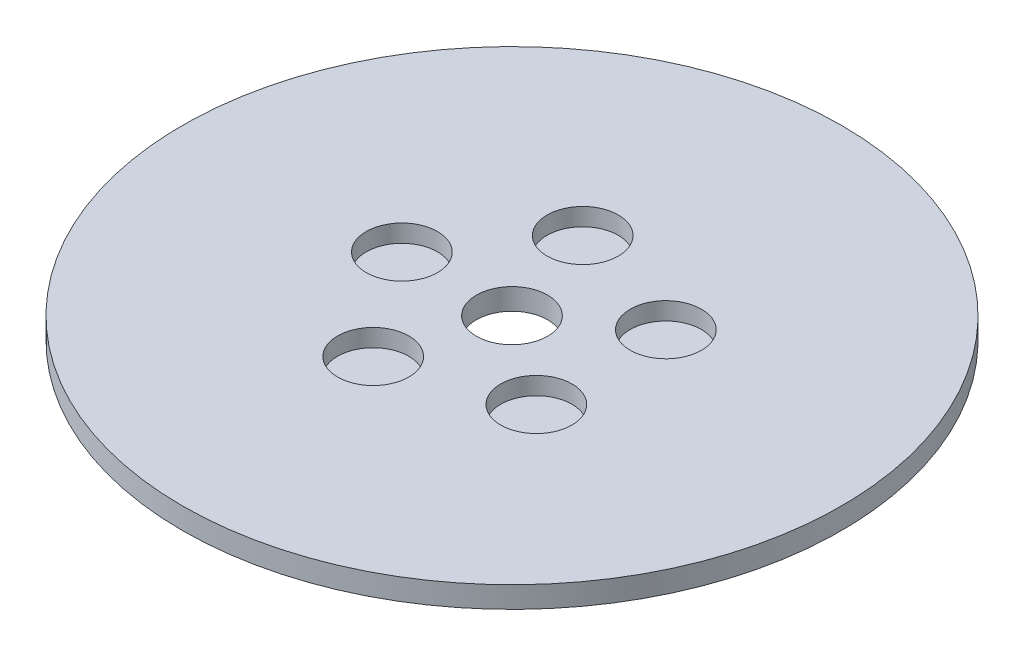
ISO-10303-21;
HEADER;
FILE_DESCRIPTION(('STEP AP214'),'2;1');
FILE_NAME('part.step','',(''),(''),'','','');
FILE_SCHEMA(('AUTOMOTIVE_DESIGN { 1 0 10303 214 1 1 1 1 }'));
ENDSEC;
DATA;
#1=APPLICATION_CONTEXT('core data for automotive mechanical design processes');
#2=APPLICATION_PROTOCOL_DEFINITION('international standard','automotive_design',2000,#1);
#3=PRODUCT_CONTEXT('',#1,'mechanical');
#4=PRODUCT('Part','Part','',(#3));
#5=PRODUCT_RELATED_PRODUCT_CATEGORY('part','',(#4));
#6=PRODUCT_DEFINITION_FORMATION('','',#4);
#7=PRODUCT_DEFINITION_CONTEXT('part definition',#1,'design');
#8=PRODUCT_DEFINITION('design','',#6,#7);
#9=PRODUCT_DEFINITION_SHAPE('','',#8);
#10=(LENGTH_UNIT() NAMED_UNIT(*) SI_UNIT(.MILLI.,.METRE.));
#11=(NAMED_UNIT(*) PLANE_ANGLE_UNIT() SI_UNIT($,.RADIAN.));
#12=(NAMED_UNIT(*) SI_UNIT($,.STERADIAN.) SOLID_ANGLE_UNIT());
#13=UNCERTAINTY_MEASURE_WITH_UNIT(LENGTH_MEASURE(1.E-05),#10,'distance_accuracy_value','');
#14=(GEOMETRIC_REPRESENTATION_CONTEXT(3) GLOBAL_UNCERTAINTY_ASSIGNED_CONTEXT((#13)) GLOBAL_UNIT_ASSIGNED_CONTEXT((#10,
#11,#12)) REPRESENTATION_CONTEXT('',''));
#15=CARTESIAN_POINT('',(0.,0.,0.));
#16=DIRECTION('',(0.,0.,1.));
#17=DIRECTION('',(1.,0.,0.));
#18=AXIS2_PLACEMENT_3D('',#15,#16,#17);
#19=CARTESIAN_POINT('',(0.,6.,0.));
#20=DIRECTION('',(0.,-1.,0.));
#21=DIRECTION('',(0.,0.,-1.));
#22=AXIS2_PLACEMENT_3D('',#19,#20,#21);
#23=CYLINDRICAL_SURFACE('',#22,92.5);
#24=CARTESIAN_POINT('',(0.,6.,0.));
#25=DIRECTION('',(0.,1.,0.));
#26=DIRECTION('',(0.,0.,1.));
#27=AXIS2_PLACEMENT_3D('',#24,#25,#26);
#28=CIRCLE('',#27,92.5);
#29=CARTESIAN_POINT('',(0.,6.,92.5));
#30=VERTEX_POINT('',#29);
#31=EDGE_CURVE('E10',#30,#30,#28,.T.);
#32=ORIENTED_EDGE('',*,*,#31,.F.);
#33=EDGE_LOOP('',(#32));
#34=FACE_BOUND('',#33,.T.);
#35=CARTESIAN_POINT('',(0.,0.,0.));
#36=DIRECTION('',(0.,1.,0.));
#37=DIRECTION('',(0.,0.,1.));
#38=AXIS2_PLACEMENT_3D('',#35,#36,#37);
#39=CIRCLE('',#38,92.5);
#40=CARTESIAN_POINT('',(0.,0.,92.5));
#41=VERTEX_POINT('',#40);
#42=EDGE_CURVE('E37',#41,#41,#39,.T.);
#43=ORIENTED_EDGE('',*,*,#42,.T.);
#44=EDGE_LOOP('',(#43));
#45=FACE_BOUND('',#44,.T.);
#46=ADVANCED_FACE('F40',(#34,#45),#23,.T.);
#47=CARTESIAN_POINT('',(0.,6.,0.));
#48=DIRECTION('',(0.,1.,0.));
#49=DIRECTION('',(0.,0.,1.));
#50=AXIS2_PLACEMENT_3D('',#47,#48,#49);
#51=PLANE('',#50);
#52=CARTESIAN_POINT('',(-9.55319121148081,6.,-29.4016993190607));
#53=DIRECTION('',(0.,1.,0.));
#54=DIRECTION('',(-0.95105651629515,0.,0.309016994374958));
#55=AXIS2_PLACEMENT_3D('',#52,#53,#54);
#56=CIRCLE('',#55,10.);
#57=CARTESIAN_POINT('',(-19.0637563744323,6.,-26.3115293753111));
#58=VERTEX_POINT('',#57);
#59=EDGE_CURVE('E70',#58,#58,#56,.T.);
#60=ORIENTED_EDGE('',*,*,#59,.F.);
#61=EDGE_LOOP('',(#60));
#62=FACE_BOUND('',#61,.T.);
#63=CARTESIAN_POINT('',(25.0105792926825,6.,-18.1712495061844));
#64=DIRECTION('',(0.,1.,0.));
#65=DIRECTION('',(-0.58778525229248,0.,-0.809016994374942));
#66=AXIS2_PLACEMENT_3D('',#63,#64,#65);
#67=CIRCLE('',#66,10.);
#68=CARTESIAN_POINT('',(19.1327267697577,6.,-26.2614194499338));
#69=VERTEX_POINT('',#68);
#70=EDGE_CURVE('E71',#69,#69,#67,.T.);
#71=ORIENTED_EDGE('',*,*,#70,.F.);
#72=EDGE_LOOP('',(#71));
#73=FACE_BOUND('',#72,.T.);
#74=CARTESIAN_POINT('',(25.0105792926828,6.,18.1712495061841));
#75=DIRECTION('',(0.,1.,0.));
#76=DIRECTION('',(0.587785252292469,0.,-0.809016994374951));
#77=AXIS2_PLACEMENT_3D('',#74,#75,#76);
#78=CIRCLE('',#77,10.);
#79=CARTESIAN_POINT('',(30.8884318156075,6.,10.0810795624345));
#80=VERTEX_POINT('',#79);
#81=EDGE_CURVE('E78',#80,#80,#78,.T.);
#82=ORIENTED_EDGE('',*,*,#81,.F.);
#83=EDGE_LOOP('',(#82));
#84=FACE_BOUND('',#83,.T.);
#85=CARTESIAN_POINT('',(-9.55319121148039,6.,29.4016993190608));
#86=DIRECTION('',(0.,1.,0.));
#87=DIRECTION('',(0.951056516295155,0.,0.309016994374945));
#88=AXIS2_PLACEMENT_3D('',#85,#86,#87);
#89=CIRCLE('',#88,10.);
#90=CARTESIAN_POINT('',(-0.0426260485288446,6.,32.4918692628102));
#91=VERTEX_POINT('',#90);
#92=EDGE_CURVE('E61',#91,#91,#89,.T.);
#93=ORIENTED_EDGE('',*,*,#92,.F.);
#94=EDGE_LOOP('',(#93));
#95=FACE_BOUND('',#94,.T.);
#96=CARTESIAN_POINT('',(-30.9147761624044,6.,0.));
#97=DIRECTION('',(0.,1.,0.));
#98=DIRECTION('',(0.,0.,1.));
#99=AXIS2_PLACEMENT_3D('',#96,#97,#98);
#100=CIRCLE('',#99,10.);
#101=CARTESIAN_POINT('',(-30.9147761624044,6.,10.));
#102=VERTEX_POINT('',#101);
#103=EDGE_CURVE('E54',#102,#102,#100,.T.);
#104=ORIENTED_EDGE('',*,*,#103,.F.);
#105=EDGE_LOOP('',(#104));
#106=FACE_BOUND('',#105,.T.);
#107=CARTESIAN_POINT('',(0.,6.,0.));
#108=DIRECTION('',(0.,1.,0.));
#109=DIRECTION('',(0.,0.,1.));
#110=AXIS2_PLACEMENT_3D('',#107,#108,#109);
#111=CIRCLE('',#110,10.);
#112=CARTESIAN_POINT('',(0.,6.,10.));
#113=VERTEX_POINT('',#112);
#114=EDGE_CURVE('E50',#113,#113,#111,.T.);
#115=ORIENTED_EDGE('',*,*,#114,.F.);
#116=EDGE_LOOP('',(#115));
#117=FACE_BOUND('',#116,.T.);
#118=ORIENTED_EDGE('',*,*,#31,.T.);
#119=EDGE_LOOP('',(#118));
#120=FACE_BOUND('',#119,.T.);
#121=ADVANCED_FACE('F94',(#62,#73,#84,#95,#106,#117,#120),#51,.T.);
#122=CARTESIAN_POINT('',(0.,0.,0.));
#123=DIRECTION('',(0.,1.,0.));
#124=DIRECTION('',(0.,0.,1.));
#125=AXIS2_PLACEMENT_3D('',#122,#123,#124);
#126=PLANE('',#125);
#127=CARTESIAN_POINT('',(0.,0.,0.));
#128=DIRECTION('',(0.,1.,0.));
#129=DIRECTION('',(0.,0.,1.));
#130=AXIS2_PLACEMENT_3D('',#127,#128,#129);
#131=CIRCLE('',#130,10.);
#132=CARTESIAN_POINT('',(0.,0.,10.));
#133=VERTEX_POINT('',#132);
#134=EDGE_CURVE('E47',#133,#133,#131,.T.);
#135=ORIENTED_EDGE('',*,*,#134,.T.);
#136=EDGE_LOOP('',(#135));
#137=FACE_BOUND('',#136,.T.);
#138=ORIENTED_EDGE('',*,*,#42,.F.);
#139=EDGE_LOOP('',(#138));
#140=FACE_BOUND('',#139,.T.);
#141=ADVANCED_FACE('F100',(#137,#140),#126,.F.);
#142=CARTESIAN_POINT('',(0.,6.,0.));
#143=DIRECTION('',(0.,-1.,0.));
#144=DIRECTION('',(0.,0.,-1.));
#145=AXIS2_PLACEMENT_3D('',#142,#143,#144);
#146=CYLINDRICAL_SURFACE('',#145,10.);
#147=ORIENTED_EDGE('',*,*,#114,.T.);
#148=EDGE_LOOP('',(#147));
#149=FACE_BOUND('',#148,.T.);
#150=ORIENTED_EDGE('',*,*,#134,.F.);
#151=EDGE_LOOP('',(#150));
#152=FACE_BOUND('',#151,.T.);
#153=ADVANCED_FACE('F106',(#149,#152),#146,.F.);
#154=CARTESIAN_POINT('',(-30.9147761624044,1.05802698753369,0.));
#155=DIRECTION('',(0.,1.,0.));
#156=DIRECTION('',(0.,0.,1.));
#157=AXIS2_PLACEMENT_3D('',#154,#155,#156);
#158=CYLINDRICAL_SURFACE('',#157,10.);
#159=CARTESIAN_POINT('',(-30.9147761624044,1.05802698753369,0.));
#160=DIRECTION('',(0.,1.,0.));
#161=DIRECTION('',(0.,0.,1.));
#162=AXIS2_PLACEMENT_3D('',#159,#160,#161);
#163=CIRCLE('',#162,10.);
#164=CARTESIAN_POINT('',(-30.9147761624044,1.05802698753369,10.));
#165=VERTEX_POINT('',#164);
#166=EDGE_CURVE('E55',#165,#165,#163,.T.);
#167=ORIENTED_EDGE('',*,*,#166,.F.);
#168=EDGE_LOOP('',(#167));
#169=FACE_BOUND('',#168,.T.);
#170=ORIENTED_EDGE('',*,*,#103,.T.);
#171=EDGE_LOOP('',(#170));
#172=FACE_BOUND('',#171,.T.);
#173=ADVANCED_FACE('F108',(#169,#172),#158,.F.);
#174=CARTESIAN_POINT('',(-30.9147761624044,1.05802698753369,0.));
#175=DIRECTION('',(0.,1.,0.));
#176=DIRECTION('',(0.,0.,1.));
#177=AXIS2_PLACEMENT_3D('',#174,#175,#176);
#178=PLANE('',#177);
#179=ORIENTED_EDGE('',*,*,#166,.T.);
#180=EDGE_LOOP('',(#179));
#181=FACE_BOUND('',#180,.T.);
#182=ADVANCED_FACE('F138',(#181),#178,.T.);
#183=CARTESIAN_POINT('',(-9.55319121148039,1.05802698753369,29.4016993190608));
#184=DIRECTION('',(0.,1.,0.));
#185=DIRECTION('',(0.,0.,1.));
#186=AXIS2_PLACEMENT_3D('',#183,#184,#185);
#187=CYLINDRICAL_SURFACE('',#186,10.);
#188=CARTESIAN_POINT('',(-9.55319121148039,1.05802698753369,29.4016993190608));
#189=DIRECTION('',(0.,1.,0.));
#190=DIRECTION('',(0.951056516295155,0.,0.309016994374945));
#191=AXIS2_PLACEMENT_3D('',#188,#189,#190);
#192=CIRCLE('',#191,10.);
#193=CARTESIAN_POINT('',(-0.0426260485288446,1.05802698753369,32.4918692628102));
#194=VERTEX_POINT('',#193);
#195=EDGE_CURVE('E59',#194,#194,#192,.T.);
#196=ORIENTED_EDGE('',*,*,#195,.F.);
#197=EDGE_LOOP('',(#196));
#198=FACE_BOUND('',#197,.T.);
#199=ORIENTED_EDGE('',*,*,#92,.T.);
#200=EDGE_LOOP('',(#199));
#201=FACE_BOUND('',#200,.T.);
#202=ADVANCED_FACE('F150',(#198,#201),#187,.F.);
#203=CARTESIAN_POINT('',(-9.55319121148039,1.05802698753369,29.4016993190608));
#204=DIRECTION('',(0.,1.,0.));
#205=DIRECTION('',(0.951056516295155,0.,0.309016994374945));
#206=AXIS2_PLACEMENT_3D('',#203,#204,#205);
#207=PLANE('',#206);
#208=ORIENTED_EDGE('',*,*,#195,.T.);
#209=EDGE_LOOP('',(#208));
#210=FACE_BOUND('',#209,.T.);
#211=ADVANCED_FACE('F89',(#210),#207,.T.);
#212=CARTESIAN_POINT('',(25.0105792926828,1.05802698753369,18.1712495061841));
#213=DIRECTION('',(0.,1.,0.));
#214=DIRECTION('',(0.,0.,1.));
#215=AXIS2_PLACEMENT_3D('',#212,#213,#214);
#216=CYLINDRICAL_SURFACE('',#215,10.);
#217=CARTESIAN_POINT('',(25.0105792926828,1.05802698753369,18.1712495061841));
#218=DIRECTION('',(0.,1.,0.));
#219=DIRECTION('',(0.587785252292469,0.,-0.809016994374951));
#220=AXIS2_PLACEMENT_3D('',#217,#218,#219);
#221=CIRCLE('',#220,10.);
#222=CARTESIAN_POINT('',(30.8884318156075,1.05802698753369,10.0810795624345));
#223=VERTEX_POINT('',#222);
#224=EDGE_CURVE('E63',#223,#223,#221,.T.);
#225=ORIENTED_EDGE('',*,*,#224,.F.);
#226=EDGE_LOOP('',(#225));
#227=FACE_BOUND('',#226,.T.);
#228=ORIENTED_EDGE('',*,*,#81,.T.);
#229=EDGE_LOOP('',(#228));
#230=FACE_BOUND('',#229,.T.);
#231=ADVANCED_FACE('F87',(#227,#230),#216,.F.);
#232=CARTESIAN_POINT('',(25.0105792926828,1.05802698753369,18.1712495061841));
#233=DIRECTION('',(0.,1.,0.));
#234=DIRECTION('',(0.587785252292469,0.,-0.809016994374951));
#235=AXIS2_PLACEMENT_3D('',#232,#233,#234);
#236=PLANE('',#235);
#237=ORIENTED_EDGE('',*,*,#224,.T.);
#238=EDGE_LOOP('',(#237));
#239=FACE_BOUND('',#238,.T.);
#240=ADVANCED_FACE('F84',(#239),#236,.T.);
#241=CARTESIAN_POINT('',(25.0105792926825,1.05802698753369,-18.1712495061844));
#242=DIRECTION('',(0.,1.,0.));
#243=DIRECTION('',(0.,0.,1.));
#244=AXIS2_PLACEMENT_3D('',#241,#242,#243);
#245=CYLINDRICAL_SURFACE('',#244,10.);
#246=CARTESIAN_POINT('',(25.0105792926825,1.05802698753369,-18.1712495061844));
#247=DIRECTION('',(0.,1.,0.));
#248=DIRECTION('',(-0.58778525229248,0.,-0.809016994374942));
#249=AXIS2_PLACEMENT_3D('',#246,#247,#248);
#250=CIRCLE('',#249,10.);
#251=CARTESIAN_POINT('',(19.1327267697577,1.05802698753369,-26.2614194499338));
#252=VERTEX_POINT('',#251);
#253=EDGE_CURVE('E76',#252,#252,#250,.T.);
#254=ORIENTED_EDGE('',*,*,#253,.F.);
#255=EDGE_LOOP('',(#254));
#256=FACE_BOUND('',#255,.T.);
#257=ORIENTED_EDGE('',*,*,#70,.T.);
#258=EDGE_LOOP('',(#257));
#259=FACE_BOUND('',#258,.T.);
#260=ADVANCED_FACE('F185',(#256,#259),#245,.F.);
#261=CARTESIAN_POINT('',(25.0105792926825,1.05802698753369,-18.1712495061844));
#262=DIRECTION('',(0.,1.,0.));
#263=DIRECTION('',(-0.58778525229248,0.,-0.809016994374942));
#264=AXIS2_PLACEMENT_3D('',#261,#262,#263);
#265=PLANE('',#264);
#266=ORIENTED_EDGE('',*,*,#253,.T.);
#267=EDGE_LOOP('',(#266));
#268=FACE_BOUND('',#267,.T.);
#269=ADVANCED_FACE('F189',(#268),#265,.T.);
#270=CARTESIAN_POINT('',(-9.55319121148081,1.05802698753369,-29.4016993190607));
#271=DIRECTION('',(0.,1.,0.));
#272=DIRECTION('',(0.,0.,1.));
#273=AXIS2_PLACEMENT_3D('',#270,#271,#272);
#274=CYLINDRICAL_SURFACE('',#273,10.);
#275=CARTESIAN_POINT('',(-9.55319121148081,1.05802698753369,-29.4016993190607));
#276=DIRECTION('',(0.,1.,0.));
#277=DIRECTION('',(-0.95105651629515,0.,0.309016994374958));
#278=AXIS2_PLACEMENT_3D('',#275,#276,#277);
#279=CIRCLE('',#278,10.);
#280=CARTESIAN_POINT('',(-19.0637563744323,1.05802698753369,-26.3115293753111));
#281=VERTEX_POINT('',#280);
#282=EDGE_CURVE('E69',#281,#281,#279,.T.);
#283=ORIENTED_EDGE('',*,*,#282,.F.);
#284=EDGE_LOOP('',(#283));
#285=FACE_BOUND('',#284,.T.);
#286=ORIENTED_EDGE('',*,*,#59,.T.);
#287=EDGE_LOOP('',(#286));
#288=FACE_BOUND('',#287,.T.);
#289=ADVANCED_FACE('F200',(#285,#288),#274,.F.);
#290=CARTESIAN_POINT('',(-9.55319121148081,1.05802698753369,-29.4016993190607));
#291=DIRECTION('',(0.,1.,0.));
#292=DIRECTION('',(-0.95105651629515,0.,0.309016994374958));
#293=AXIS2_PLACEMENT_3D('',#290,#291,#292);
#294=PLANE('',#293);
#295=ORIENTED_EDGE('',*,*,#282,.T.);
#296=EDGE_LOOP('',(#295));
#297=FACE_BOUND('',#296,.T.);
#298=ADVANCED_FACE('F208',(#297),#294,.T.);
#299=CLOSED_SHELL('',(#46,#121,#141,#153,#173,#182,#202,#211,#231,#240,#260,#269,#289,#298));
#300=MANIFOLD_SOLID_BREP('B2',#299);
#301=ADVANCED_BREP_SHAPE_REPRESENTATION('',(#18,#300),#14);
#302=SHAPE_DEFINITION_REPRESENTATION(#9,#301);
ENDSEC;
END-ISO-10303-21;
